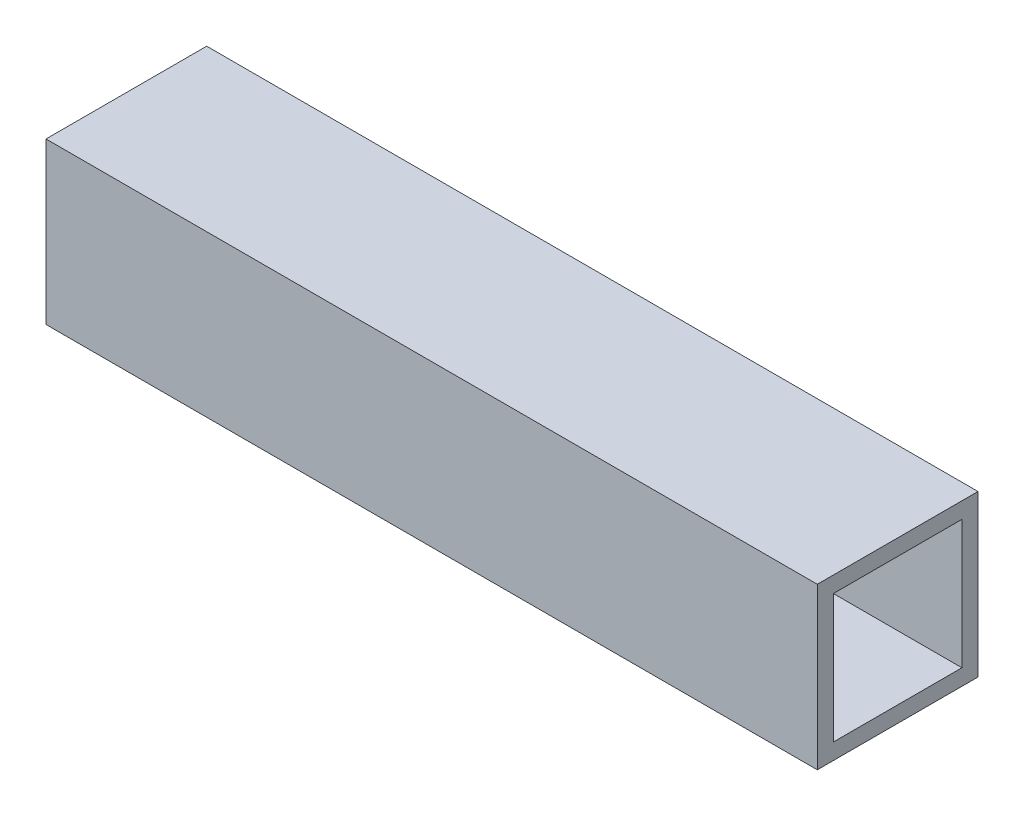
ISO-10303-21;
HEADER;
FILE_DESCRIPTION(('STEP AP214'),'2;1');
FILE_NAME('part.step','',(''),(''),'','','');
FILE_SCHEMA(('AUTOMOTIVE_DESIGN { 1 0 10303 214 1 1 1 1 }'));
ENDSEC;
DATA;
#1=APPLICATION_CONTEXT('core data for automotive mechanical design processes');
#2=APPLICATION_PROTOCOL_DEFINITION('international standard','automotive_design',2000,#1);
#3=PRODUCT_CONTEXT('',#1,'mechanical');
#4=PRODUCT('Part','Part','',(#3));
#5=PRODUCT_RELATED_PRODUCT_CATEGORY('part','',(#4));
#6=PRODUCT_DEFINITION_FORMATION('','',#4);
#7=PRODUCT_DEFINITION_CONTEXT('part definition',#1,'design');
#8=PRODUCT_DEFINITION('design','',#6,#7);
#9=PRODUCT_DEFINITION_SHAPE('','',#8);
#10=(LENGTH_UNIT() NAMED_UNIT(*) SI_UNIT(.MILLI.,.METRE.));
#11=(NAMED_UNIT(*) PLANE_ANGLE_UNIT() SI_UNIT($,.RADIAN.));
#12=(NAMED_UNIT(*) SI_UNIT($,.STERADIAN.) SOLID_ANGLE_UNIT());
#13=UNCERTAINTY_MEASURE_WITH_UNIT(LENGTH_MEASURE(1.E-05),#10,'distance_accuracy_value','');
#14=(GEOMETRIC_REPRESENTATION_CONTEXT(3) GLOBAL_UNCERTAINTY_ASSIGNED_CONTEXT((#13)) GLOBAL_UNIT_ASSIGNED_CONTEXT((#10,
#11,#12)) REPRESENTATION_CONTEXT('',''));
#15=CARTESIAN_POINT('',(0.,0.,0.));
#16=DIRECTION('',(0.,0.,1.));
#17=DIRECTION('',(1.,0.,0.));
#18=AXIS2_PLACEMENT_3D('',#15,#16,#17);
#19=CARTESIAN_POINT('',(152.4,0.,0.));
#20=DIRECTION('',(1.,0.,0.));
#21=DIRECTION('',(0.,0.,-1.));
#22=AXIS2_PLACEMENT_3D('',#19,#20,#21);
#23=PLANE('',#22);
#24=DIRECTION('',(0.,0.,-1.));
#25=VECTOR('',#24,1.);
#26=CARTESIAN_POINT('',(152.4,-31.75,31.75));
#27=LINE('',#26,#25);
#28=CARTESIAN_POINT('',(152.4,-31.75,31.75));
#29=VERTEX_POINT('',#28);
#30=CARTESIAN_POINT('',(152.4,-31.75,-31.75));
#31=VERTEX_POINT('',#30);
#32=EDGE_CURVE('E139',#29,#31,#27,.T.);
#33=ORIENTED_EDGE('',*,*,#32,.T.);
#34=DIRECTION('',(0.,1.,0.));
#35=VECTOR('',#34,1.);
#36=CARTESIAN_POINT('',(152.4,-31.75,-31.75));
#37=LINE('',#36,#35);
#38=CARTESIAN_POINT('',(152.4,31.75,-31.75));
#39=VERTEX_POINT('',#38);
#40=EDGE_CURVE('E142',#31,#39,#37,.T.);
#41=ORIENTED_EDGE('',*,*,#40,.T.);
#42=DIRECTION('',(0.,0.,1.));
#43=VECTOR('',#42,1.);
#44=CARTESIAN_POINT('',(152.4,31.75,31.75));
#45=LINE('',#44,#43);
#46=CARTESIAN_POINT('',(152.4,31.75,31.75));
#47=VERTEX_POINT('',#46);
#48=EDGE_CURVE('E145',#39,#47,#45,.T.);
#49=ORIENTED_EDGE('',*,*,#48,.T.);
#50=DIRECTION('',(0.,-1.,0.));
#51=VECTOR('',#50,1.);
#52=CARTESIAN_POINT('',(152.4,-31.75,31.75));
#53=LINE('',#52,#51);
#54=EDGE_CURVE('E147',#47,#29,#53,.T.);
#55=ORIENTED_EDGE('',*,*,#54,.T.);
#56=EDGE_LOOP('',(#33,#41,#49,#55));
#57=FACE_BOUND('',#56,.T.);
#58=DIRECTION('',(0.,0.,1.));
#59=VECTOR('',#58,1.);
#60=CARTESIAN_POINT('',(152.4,25.4,25.4));
#61=LINE('',#60,#59);
#62=CARTESIAN_POINT('',(152.4,25.4,-25.4));
#63=VERTEX_POINT('',#62);
#64=CARTESIAN_POINT('',(152.4,25.4,25.4));
#65=VERTEX_POINT('',#64);
#66=EDGE_CURVE('E111',#63,#65,#61,.T.);
#67=ORIENTED_EDGE('',*,*,#66,.F.);
#68=DIRECTION('',(0.,1.,0.));
#69=VECTOR('',#68,1.);
#70=CARTESIAN_POINT('',(152.4,-25.4,-25.4));
#71=LINE('',#70,#69);
#72=CARTESIAN_POINT('',(152.4,-25.4,-25.4));
#73=VERTEX_POINT('',#72);
#74=EDGE_CURVE('E103',#73,#63,#71,.T.);
#75=ORIENTED_EDGE('',*,*,#74,.F.);
#76=DIRECTION('',(0.,0.,-1.));
#77=VECTOR('',#76,1.);
#78=CARTESIAN_POINT('',(152.4,-25.4,25.4));
#79=LINE('',#78,#77);
#80=CARTESIAN_POINT('',(152.4,-25.4,25.4));
#81=VERTEX_POINT('',#80);
#82=EDGE_CURVE('E125',#81,#73,#79,.T.);
#83=ORIENTED_EDGE('',*,*,#82,.F.);
#84=DIRECTION('',(0.,-1.,0.));
#85=VECTOR('',#84,1.);
#86=CARTESIAN_POINT('',(152.4,-25.4,25.4));
#87=LINE('',#86,#85);
#88=EDGE_CURVE('E123',#65,#81,#87,.T.);
#89=ORIENTED_EDGE('',*,*,#88,.F.);
#90=EDGE_LOOP('',(#67,#75,#83,#89));
#91=FACE_BOUND('',#90,.T.);
#92=ADVANCED_FACE('F38',(#57,#91),#23,.T.);
#93=CARTESIAN_POINT('',(-152.4,0.,0.));
#94=DIRECTION('',(1.,0.,0.));
#95=DIRECTION('',(0.,0.,-1.));
#96=AXIS2_PLACEMENT_3D('',#93,#94,#95);
#97=PLANE('',#96);
#98=DIRECTION('',(0.,0.,-1.));
#99=VECTOR('',#98,1.);
#100=CARTESIAN_POINT('',(-152.4,-31.75,31.75));
#101=LINE('',#100,#99);
#102=CARTESIAN_POINT('',(-152.4,-31.75,31.75));
#103=VERTEX_POINT('',#102);
#104=CARTESIAN_POINT('',(-152.4,-31.75,-31.75));
#105=VERTEX_POINT('',#104);
#106=EDGE_CURVE('E119',#103,#105,#101,.T.);
#107=ORIENTED_EDGE('',*,*,#106,.F.);
#108=DIRECTION('',(0.,-1.,0.));
#109=VECTOR('',#108,1.);
#110=CARTESIAN_POINT('',(-152.4,-31.75,31.75));
#111=LINE('',#110,#109);
#112=CARTESIAN_POINT('',(-152.4,31.75,31.75));
#113=VERTEX_POINT('',#112);
#114=EDGE_CURVE('E143',#113,#103,#111,.T.);
#115=ORIENTED_EDGE('',*,*,#114,.F.);
#116=DIRECTION('',(0.,0.,1.));
#117=VECTOR('',#116,1.);
#118=CARTESIAN_POINT('',(-152.4,31.75,31.75));
#119=LINE('',#118,#117);
#120=CARTESIAN_POINT('',(-152.4,31.75,-31.75));
#121=VERTEX_POINT('',#120);
#122=EDGE_CURVE('E154',#121,#113,#119,.T.);
#123=ORIENTED_EDGE('',*,*,#122,.F.);
#124=DIRECTION('',(0.,1.,0.));
#125=VECTOR('',#124,1.);
#126=CARTESIAN_POINT('',(-152.4,-31.75,-31.75));
#127=LINE('',#126,#125);
#128=EDGE_CURVE('E152',#105,#121,#127,.T.);
#129=ORIENTED_EDGE('',*,*,#128,.F.);
#130=EDGE_LOOP('',(#107,#115,#123,#129));
#131=FACE_BOUND('',#130,.T.);
#132=DIRECTION('',(0.,1.,0.));
#133=VECTOR('',#132,1.);
#134=CARTESIAN_POINT('',(-152.4,-25.4,-25.4));
#135=LINE('',#134,#133);
#136=CARTESIAN_POINT('',(-152.4,-25.4,-25.4));
#137=VERTEX_POINT('',#136);
#138=CARTESIAN_POINT('',(-152.4,25.4,-25.4));
#139=VERTEX_POINT('',#138);
#140=EDGE_CURVE('E61',#137,#139,#135,.T.);
#141=ORIENTED_EDGE('',*,*,#140,.T.);
#142=DIRECTION('',(0.,0.,1.));
#143=VECTOR('',#142,1.);
#144=CARTESIAN_POINT('',(-152.4,25.4,25.4));
#145=LINE('',#144,#143);
#146=CARTESIAN_POINT('',(-152.4,25.4,25.4));
#147=VERTEX_POINT('',#146);
#148=EDGE_CURVE('E118',#139,#147,#145,.T.);
#149=ORIENTED_EDGE('',*,*,#148,.T.);
#150=DIRECTION('',(0.,-1.,0.));
#151=VECTOR('',#150,1.);
#152=CARTESIAN_POINT('',(-152.4,-25.4,25.4));
#153=LINE('',#152,#151);
#154=CARTESIAN_POINT('',(-152.4,-25.4,25.4));
#155=VERTEX_POINT('',#154);
#156=EDGE_CURVE('E131',#147,#155,#153,.T.);
#157=ORIENTED_EDGE('',*,*,#156,.T.);
#158=DIRECTION('',(0.,0.,-1.));
#159=VECTOR('',#158,1.);
#160=CARTESIAN_POINT('',(-152.4,-25.4,25.4));
#161=LINE('',#160,#159);
#162=EDGE_CURVE('E112',#155,#137,#161,.T.);
#163=ORIENTED_EDGE('',*,*,#162,.T.);
#164=EDGE_LOOP('',(#141,#149,#157,#163));
#165=FACE_BOUND('',#164,.T.);
#166=ADVANCED_FACE('F172',(#131,#165),#97,.F.);
#167=CARTESIAN_POINT('',(152.4,-31.75,31.75));
#168=DIRECTION('',(0.,1.,0.));
#169=DIRECTION('',(0.,0.,1.));
#170=AXIS2_PLACEMENT_3D('',#167,#168,#169);
#171=PLANE('',#170);
#172=ORIENTED_EDGE('',*,*,#106,.T.);
#173=DIRECTION('',(-1.,0.,0.));
#174=VECTOR('',#173,1.);
#175=CARTESIAN_POINT('',(152.4,-31.75,-31.75));
#176=LINE('',#175,#174);
#177=EDGE_CURVE('E11',#31,#105,#176,.T.);
#178=ORIENTED_EDGE('',*,*,#177,.F.);
#179=ORIENTED_EDGE('',*,*,#32,.F.);
#180=DIRECTION('',(-1.,0.,0.));
#181=VECTOR('',#180,1.);
#182=CARTESIAN_POINT('',(152.4,-31.75,31.75));
#183=LINE('',#182,#181);
#184=EDGE_CURVE('E149',#29,#103,#183,.T.);
#185=ORIENTED_EDGE('',*,*,#184,.T.);
#186=EDGE_LOOP('',(#172,#178,#179,#185));
#187=FACE_BOUND('',#186,.T.);
#188=ADVANCED_FACE('F40',(#187),#171,.F.);
#189=CARTESIAN_POINT('',(152.4,-31.75,-31.75));
#190=DIRECTION('',(0.,0.,1.));
#191=DIRECTION('',(1.,0.,0.));
#192=AXIS2_PLACEMENT_3D('',#189,#190,#191);
#193=PLANE('',#192);
#194=ORIENTED_EDGE('',*,*,#128,.T.);
#195=DIRECTION('',(-1.,0.,0.));
#196=VECTOR('',#195,1.);
#197=CARTESIAN_POINT('',(152.4,31.75,-31.75));
#198=LINE('',#197,#196);
#199=EDGE_CURVE('E46',#39,#121,#198,.T.);
#200=ORIENTED_EDGE('',*,*,#199,.F.);
#201=ORIENTED_EDGE('',*,*,#40,.F.);
#202=ORIENTED_EDGE('',*,*,#177,.T.);
#203=EDGE_LOOP('',(#194,#200,#201,#202));
#204=FACE_BOUND('',#203,.T.);
#205=ADVANCED_FACE('F182',(#204),#193,.F.);
#206=CARTESIAN_POINT('',(152.4,31.75,31.75));
#207=DIRECTION('',(0.,-1.,0.));
#208=DIRECTION('',(0.,0.,-1.));
#209=AXIS2_PLACEMENT_3D('',#206,#207,#208);
#210=PLANE('',#209);
#211=ORIENTED_EDGE('',*,*,#122,.T.);
#212=DIRECTION('',(-1.,0.,0.));
#213=VECTOR('',#212,1.);
#214=CARTESIAN_POINT('',(152.4,31.75,31.75));
#215=LINE('',#214,#213);
#216=EDGE_CURVE('E159',#47,#113,#215,.T.);
#217=ORIENTED_EDGE('',*,*,#216,.F.);
#218=ORIENTED_EDGE('',*,*,#48,.F.);
#219=ORIENTED_EDGE('',*,*,#199,.T.);
#220=EDGE_LOOP('',(#211,#217,#218,#219));
#221=FACE_BOUND('',#220,.T.);
#222=ADVANCED_FACE('F166',(#221),#210,.F.);
#223=CARTESIAN_POINT('',(152.4,-31.75,31.75));
#224=DIRECTION('',(0.,0.,-1.));
#225=DIRECTION('',(-1.,0.,0.));
#226=AXIS2_PLACEMENT_3D('',#223,#224,#225);
#227=PLANE('',#226);
#228=ORIENTED_EDGE('',*,*,#114,.T.);
#229=ORIENTED_EDGE('',*,*,#184,.F.);
#230=ORIENTED_EDGE('',*,*,#54,.F.);
#231=ORIENTED_EDGE('',*,*,#216,.T.);
#232=EDGE_LOOP('',(#228,#229,#230,#231));
#233=FACE_BOUND('',#232,.T.);
#234=ADVANCED_FACE('F176',(#233),#227,.F.);
#235=CARTESIAN_POINT('',(152.4,-25.4,-25.4));
#236=DIRECTION('',(0.,0.,1.));
#237=DIRECTION('',(1.,0.,0.));
#238=AXIS2_PLACEMENT_3D('',#235,#236,#237);
#239=PLANE('',#238);
#240=ORIENTED_EDGE('',*,*,#140,.F.);
#241=DIRECTION('',(-1.,0.,0.));
#242=VECTOR('',#241,1.);
#243=CARTESIAN_POINT('',(152.4,-25.4,-25.4));
#244=LINE('',#243,#242);
#245=EDGE_CURVE('E107',#73,#137,#244,.T.);
#246=ORIENTED_EDGE('',*,*,#245,.F.);
#247=ORIENTED_EDGE('',*,*,#74,.T.);
#248=DIRECTION('',(-1.,0.,0.));
#249=VECTOR('',#248,1.);
#250=CARTESIAN_POINT('',(152.4,25.4,-25.4));
#251=LINE('',#250,#249);
#252=EDGE_CURVE('E106',#63,#139,#251,.T.);
#253=ORIENTED_EDGE('',*,*,#252,.T.);
#254=EDGE_LOOP('',(#240,#246,#247,#253));
#255=FACE_BOUND('',#254,.T.);
#256=ADVANCED_FACE('F105',(#255),#239,.T.);
#257=CARTESIAN_POINT('',(152.4,25.4,25.4));
#258=DIRECTION('',(0.,-1.,0.));
#259=DIRECTION('',(0.,0.,-1.));
#260=AXIS2_PLACEMENT_3D('',#257,#258,#259);
#261=PLANE('',#260);
#262=ORIENTED_EDGE('',*,*,#148,.F.);
#263=ORIENTED_EDGE('',*,*,#252,.F.);
#264=ORIENTED_EDGE('',*,*,#66,.T.);
#265=DIRECTION('',(-1.,0.,0.));
#266=VECTOR('',#265,1.);
#267=CARTESIAN_POINT('',(152.4,25.4,25.4));
#268=LINE('',#267,#266);
#269=EDGE_CURVE('E120',#65,#147,#268,.T.);
#270=ORIENTED_EDGE('',*,*,#269,.T.);
#271=EDGE_LOOP('',(#262,#263,#264,#270));
#272=FACE_BOUND('',#271,.T.);
#273=ADVANCED_FACE('F115',(#272),#261,.T.);
#274=CARTESIAN_POINT('',(152.4,-25.4,25.4));
#275=DIRECTION('',(0.,0.,-1.));
#276=DIRECTION('',(-1.,0.,0.));
#277=AXIS2_PLACEMENT_3D('',#274,#275,#276);
#278=PLANE('',#277);
#279=ORIENTED_EDGE('',*,*,#156,.F.);
#280=ORIENTED_EDGE('',*,*,#269,.F.);
#281=ORIENTED_EDGE('',*,*,#88,.T.);
#282=DIRECTION('',(-1.,0.,0.));
#283=VECTOR('',#282,1.);
#284=CARTESIAN_POINT('',(152.4,-25.4,25.4));
#285=LINE('',#284,#283);
#286=EDGE_CURVE('E53',#81,#155,#285,.T.);
#287=ORIENTED_EDGE('',*,*,#286,.T.);
#288=EDGE_LOOP('',(#279,#280,#281,#287));
#289=FACE_BOUND('',#288,.T.);
#290=ADVANCED_FACE('F205',(#289),#278,.T.);
#291=CARTESIAN_POINT('',(152.4,-25.4,25.4));
#292=DIRECTION('',(0.,1.,0.));
#293=DIRECTION('',(0.,0.,1.));
#294=AXIS2_PLACEMENT_3D('',#291,#292,#293);
#295=PLANE('',#294);
#296=ORIENTED_EDGE('',*,*,#162,.F.);
#297=ORIENTED_EDGE('',*,*,#286,.F.);
#298=ORIENTED_EDGE('',*,*,#82,.T.);
#299=ORIENTED_EDGE('',*,*,#245,.T.);
#300=EDGE_LOOP('',(#296,#297,#298,#299));
#301=FACE_BOUND('',#300,.T.);
#302=ADVANCED_FACE('F209',(#301),#295,.T.);
#303=CLOSED_SHELL('',(#92,#166,#188,#205,#222,#234,#256,#273,#290,#302));
#304=MANIFOLD_SOLID_BREP('B2',#303);
#305=ADVANCED_BREP_SHAPE_REPRESENTATION('',(#18,#304),#14);
#306=SHAPE_DEFINITION_REPRESENTATION(#9,#305);
ENDSEC;
END-ISO-10303-21;
